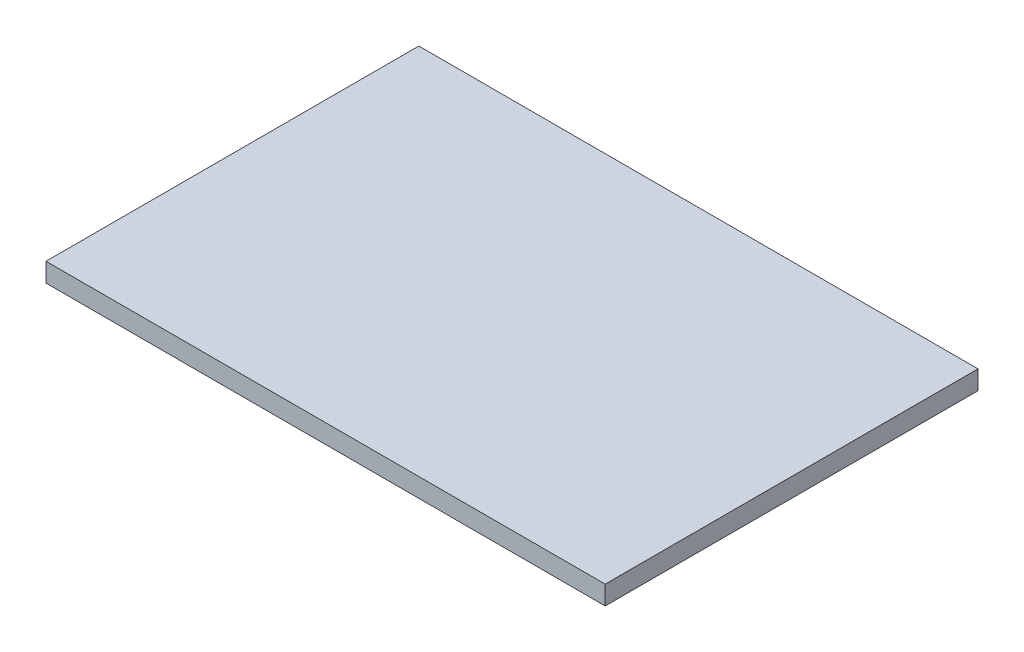
ISO-10303-21;
HEADER;
FILE_DESCRIPTION(('STEP AP214'),'2;1');
FILE_NAME('part.step','',(''),(''),'','','');
FILE_SCHEMA(('AUTOMOTIVE_DESIGN { 1 0 10303 214 1 1 1 1 }'));
ENDSEC;
DATA;
#1=APPLICATION_CONTEXT('core data for automotive mechanical design processes');
#2=APPLICATION_PROTOCOL_DEFINITION('international standard','automotive_design',2000,#1);
#3=PRODUCT_CONTEXT('',#1,'mechanical');
#4=PRODUCT('Part','Part','',(#3));
#5=PRODUCT_RELATED_PRODUCT_CATEGORY('part','',(#4));
#6=PRODUCT_DEFINITION_FORMATION('','',#4);
#7=PRODUCT_DEFINITION_CONTEXT('part definition',#1,'design');
#8=PRODUCT_DEFINITION('design','',#6,#7);
#9=PRODUCT_DEFINITION_SHAPE('','',#8);
#10=(LENGTH_UNIT() NAMED_UNIT(*) SI_UNIT(.MILLI.,.METRE.));
#11=(NAMED_UNIT(*) PLANE_ANGLE_UNIT() SI_UNIT($,.RADIAN.));
#12=(NAMED_UNIT(*) SI_UNIT($,.STERADIAN.) SOLID_ANGLE_UNIT());
#13=UNCERTAINTY_MEASURE_WITH_UNIT(LENGTH_MEASURE(1.E-05),#10,'distance_accuracy_value','');
#14=(GEOMETRIC_REPRESENTATION_CONTEXT(3) GLOBAL_UNCERTAINTY_ASSIGNED_CONTEXT((#13)) GLOBAL_UNIT_ASSIGNED_CONTEXT((#10,
#11,#12)) REPRESENTATION_CONTEXT('',''));
#15=CARTESIAN_POINT('',(0.,0.,0.));
#16=DIRECTION('',(0.,0.,1.));
#17=DIRECTION('',(1.,0.,0.));
#18=AXIS2_PLACEMENT_3D('',#15,#16,#17);
#19=CARTESIAN_POINT('',(375.,25.4,250.));
#20=DIRECTION('',(-1.,0.,0.));
#21=DIRECTION('',(0.,0.,1.));
#22=AXIS2_PLACEMENT_3D('',#19,#20,#21);
#23=PLANE('',#22);
#24=DIRECTION('',(0.,0.,-1.));
#25=VECTOR('',#24,1.);
#26=CARTESIAN_POINT('',(375.,0.,250.));
#27=LINE('',#26,#25);
#28=CARTESIAN_POINT('',(375.,0.,250.));
#29=VERTEX_POINT('',#28);
#30=CARTESIAN_POINT('',(375.,0.,-250.));
#31=VERTEX_POINT('',#30);
#32=EDGE_CURVE('E95',#29,#31,#27,.T.);
#33=ORIENTED_EDGE('',*,*,#32,.T.);
#34=DIRECTION('',(0.,-1.,0.));
#35=VECTOR('',#34,1.);
#36=CARTESIAN_POINT('',(375.,25.4,-250.));
#37=LINE('',#36,#35);
#38=CARTESIAN_POINT('',(375.,25.4,-250.));
#39=VERTEX_POINT('',#38);
#40=EDGE_CURVE('E11',#39,#31,#37,.T.);
#41=ORIENTED_EDGE('',*,*,#40,.F.);
#42=DIRECTION('',(0.,0.,-1.));
#43=VECTOR('',#42,1.);
#44=CARTESIAN_POINT('',(375.,25.4,250.));
#45=LINE('',#44,#43);
#46=CARTESIAN_POINT('',(375.,25.4,250.));
#47=VERTEX_POINT('',#46);
#48=EDGE_CURVE('E83',#47,#39,#45,.T.);
#49=ORIENTED_EDGE('',*,*,#48,.F.);
#50=DIRECTION('',(0.,-1.,0.));
#51=VECTOR('',#50,1.);
#52=CARTESIAN_POINT('',(375.,25.4,250.));
#53=LINE('',#52,#51);
#54=EDGE_CURVE('E91',#47,#29,#53,.T.);
#55=ORIENTED_EDGE('',*,*,#54,.T.);
#56=EDGE_LOOP('',(#33,#41,#49,#55));
#57=FACE_BOUND('',#56,.T.);
#58=ADVANCED_FACE('F32',(#57),#23,.F.);
#59=CARTESIAN_POINT('',(-375.,25.4,-250.));
#60=DIRECTION('',(0.,0.,1.));
#61=DIRECTION('',(1.,0.,0.));
#62=AXIS2_PLACEMENT_3D('',#59,#60,#61);
#63=PLANE('',#62);
#64=DIRECTION('',(-1.,0.,0.));
#65=VECTOR('',#64,1.);
#66=CARTESIAN_POINT('',(-375.,0.,-250.));
#67=LINE('',#66,#65);
#68=CARTESIAN_POINT('',(-375.,0.,-250.));
#69=VERTEX_POINT('',#68);
#70=EDGE_CURVE('E87',#31,#69,#67,.T.);
#71=ORIENTED_EDGE('',*,*,#70,.T.);
#72=DIRECTION('',(0.,-1.,0.));
#73=VECTOR('',#72,1.);
#74=CARTESIAN_POINT('',(-375.,25.4,-250.));
#75=LINE('',#74,#73);
#76=CARTESIAN_POINT('',(-375.,25.4,-250.));
#77=VERTEX_POINT('',#76);
#78=EDGE_CURVE('E40',#77,#69,#75,.T.);
#79=ORIENTED_EDGE('',*,*,#78,.F.);
#80=DIRECTION('',(-1.,0.,0.));
#81=VECTOR('',#80,1.);
#82=CARTESIAN_POINT('',(-375.,25.4,-250.));
#83=LINE('',#82,#81);
#84=EDGE_CURVE('E78',#39,#77,#83,.T.);
#85=ORIENTED_EDGE('',*,*,#84,.F.);
#86=ORIENTED_EDGE('',*,*,#40,.T.);
#87=EDGE_LOOP('',(#71,#79,#85,#86));
#88=FACE_BOUND('',#87,.T.);
#89=ADVANCED_FACE('F86',(#88),#63,.F.);
#90=CARTESIAN_POINT('',(-375.,25.4,250.));
#91=DIRECTION('',(1.,0.,0.));
#92=DIRECTION('',(0.,0.,-1.));
#93=AXIS2_PLACEMENT_3D('',#90,#91,#92);
#94=PLANE('',#93);
#95=DIRECTION('',(0.,0.,1.));
#96=VECTOR('',#95,1.);
#97=CARTESIAN_POINT('',(-375.,0.,250.));
#98=LINE('',#97,#96);
#99=CARTESIAN_POINT('',(-375.,0.,250.));
#100=VERTEX_POINT('',#99);
#101=EDGE_CURVE('E65',#69,#100,#98,.T.);
#102=ORIENTED_EDGE('',*,*,#101,.T.);
#103=DIRECTION('',(0.,-1.,0.));
#104=VECTOR('',#103,1.);
#105=CARTESIAN_POINT('',(-375.,25.4,250.));
#106=LINE('',#105,#104);
#107=CARTESIAN_POINT('',(-375.,25.4,250.));
#108=VERTEX_POINT('',#107);
#109=EDGE_CURVE('E88',#108,#100,#106,.T.);
#110=ORIENTED_EDGE('',*,*,#109,.F.);
#111=DIRECTION('',(0.,0.,1.));
#112=VECTOR('',#111,1.);
#113=CARTESIAN_POINT('',(-375.,25.4,250.));
#114=LINE('',#113,#112);
#115=EDGE_CURVE('E81',#77,#108,#114,.T.);
#116=ORIENTED_EDGE('',*,*,#115,.F.);
#117=ORIENTED_EDGE('',*,*,#78,.T.);
#118=EDGE_LOOP('',(#102,#110,#116,#117));
#119=FACE_BOUND('',#118,.T.);
#120=ADVANCED_FACE('F89',(#119),#94,.F.);
#121=CARTESIAN_POINT('',(-375.,25.4,250.));
#122=DIRECTION('',(0.,0.,-1.));
#123=DIRECTION('',(-1.,0.,0.));
#124=AXIS2_PLACEMENT_3D('',#121,#122,#123);
#125=PLANE('',#124);
#126=DIRECTION('',(1.,0.,0.));
#127=VECTOR('',#126,1.);
#128=CARTESIAN_POINT('',(-375.,0.,250.));
#129=LINE('',#128,#127);
#130=EDGE_CURVE('E71',#100,#29,#129,.T.);
#131=ORIENTED_EDGE('',*,*,#130,.T.);
#132=ORIENTED_EDGE('',*,*,#54,.F.);
#133=DIRECTION('',(1.,0.,0.));
#134=VECTOR('',#133,1.);
#135=CARTESIAN_POINT('',(-375.,25.4,250.));
#136=LINE('',#135,#134);
#137=EDGE_CURVE('E48',#108,#47,#136,.T.);
#138=ORIENTED_EDGE('',*,*,#137,.F.);
#139=ORIENTED_EDGE('',*,*,#109,.T.);
#140=EDGE_LOOP('',(#131,#132,#138,#139));
#141=FACE_BOUND('',#140,.T.);
#142=ADVANCED_FACE('F102',(#141),#125,.F.);
#143=CARTESIAN_POINT('',(0.,25.4,0.));
#144=DIRECTION('',(0.,-1.,0.));
#145=DIRECTION('',(0.,0.,-1.));
#146=AXIS2_PLACEMENT_3D('',#143,#144,#145);
#147=PLANE('',#146);
#148=ORIENTED_EDGE('',*,*,#48,.T.);
#149=ORIENTED_EDGE('',*,*,#84,.T.);
#150=ORIENTED_EDGE('',*,*,#115,.T.);
#151=ORIENTED_EDGE('',*,*,#137,.T.);
#152=EDGE_LOOP('',(#148,#149,#150,#151));
#153=FACE_BOUND('',#152,.T.);
#154=ADVANCED_FACE('F79',(#153),#147,.F.);
#155=CARTESIAN_POINT('',(0.,0.,0.));
#156=DIRECTION('',(0.,-1.,0.));
#157=DIRECTION('',(0.,0.,-1.));
#158=AXIS2_PLACEMENT_3D('',#155,#156,#157);
#159=PLANE('',#158);
#160=ORIENTED_EDGE('',*,*,#32,.F.);
#161=ORIENTED_EDGE('',*,*,#130,.F.);
#162=ORIENTED_EDGE('',*,*,#101,.F.);
#163=ORIENTED_EDGE('',*,*,#70,.F.);
#164=EDGE_LOOP('',(#160,#161,#162,#163));
#165=FACE_BOUND('',#164,.T.);
#166=ADVANCED_FACE('F105',(#165),#159,.T.);
#167=CLOSED_SHELL('',(#58,#89,#120,#142,#154,#166));
#168=MANIFOLD_SOLID_BREP('B2',#167);
#169=ADVANCED_BREP_SHAPE_REPRESENTATION('',(#18,#168),#14);
#170=SHAPE_DEFINITION_REPRESENTATION(#9,#169);
ENDSEC;
END-ISO-10303-21;
